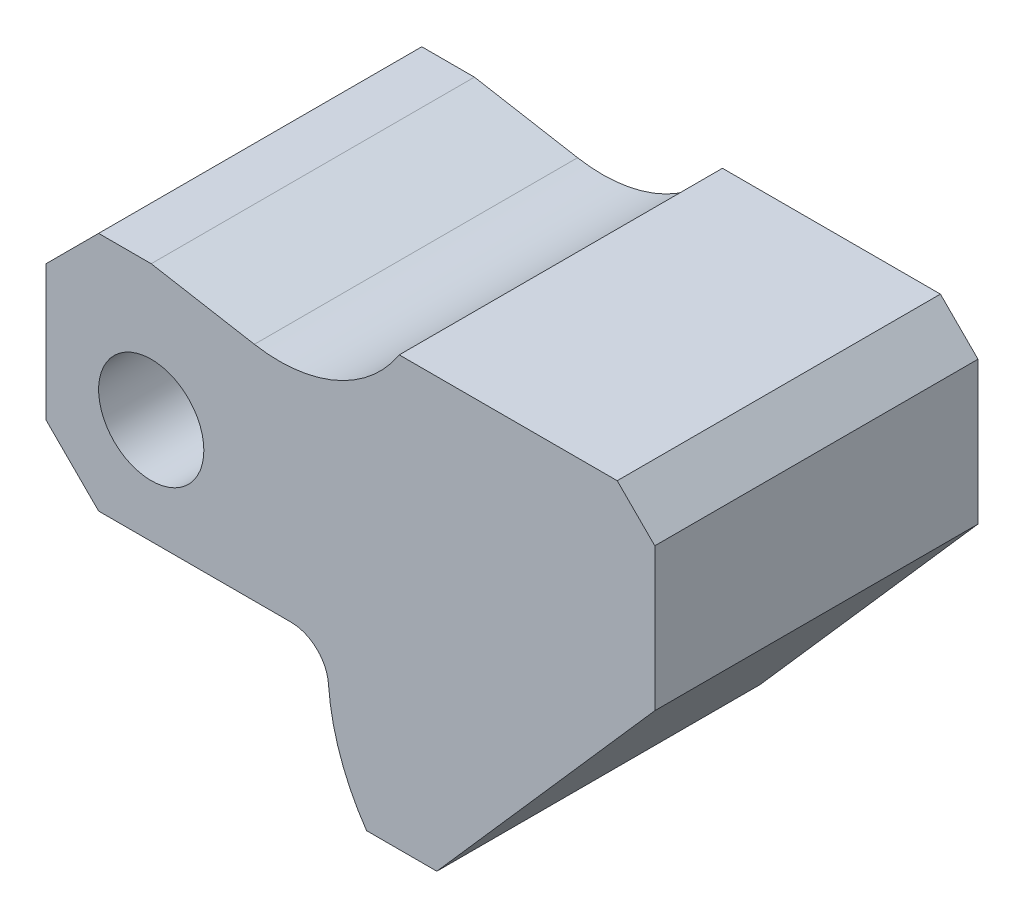
ISO-10303-21;
HEADER;
FILE_DESCRIPTION(('STEP AP214'),'2;1');
FILE_NAME('part.step','',(''),(''),'','','');
FILE_SCHEMA(('AUTOMOTIVE_DESIGN { 1 0 10303 214 1 1 1 1 }'));
ENDSEC;
DATA;
#1=APPLICATION_CONTEXT('core data for automotive mechanical design processes');
#2=APPLICATION_PROTOCOL_DEFINITION('international standard','automotive_design',2000,#1);
#3=PRODUCT_CONTEXT('',#1,'mechanical');
#4=PRODUCT('Part','Part','',(#3));
#5=PRODUCT_RELATED_PRODUCT_CATEGORY('part','',(#4));
#6=PRODUCT_DEFINITION_FORMATION('','',#4);
#7=PRODUCT_DEFINITION_CONTEXT('part definition',#1,'design');
#8=PRODUCT_DEFINITION('design','',#6,#7);
#9=PRODUCT_DEFINITION_SHAPE('','',#8);
#10=(LENGTH_UNIT() NAMED_UNIT(*) SI_UNIT(.MILLI.,.METRE.));
#11=(NAMED_UNIT(*) PLANE_ANGLE_UNIT() SI_UNIT($,.RADIAN.));
#12=(NAMED_UNIT(*) SI_UNIT($,.STERADIAN.) SOLID_ANGLE_UNIT());
#13=UNCERTAINTY_MEASURE_WITH_UNIT(LENGTH_MEASURE(1.E-05),#10,'distance_accuracy_value','');
#14=(GEOMETRIC_REPRESENTATION_CONTEXT(3) GLOBAL_UNCERTAINTY_ASSIGNED_CONTEXT((#13)) GLOBAL_UNIT_ASSIGNED_CONTEXT((#10,
#11,#12)) REPRESENTATION_CONTEXT('',''));
#15=CARTESIAN_POINT('',(0.,0.,0.));
#16=DIRECTION('',(0.,0.,1.));
#17=DIRECTION('',(1.,0.,0.));
#18=AXIS2_PLACEMENT_3D('',#15,#16,#17);
#19=CARTESIAN_POINT('',(17.028040312093,34.2906026902158,43.));
#20=DIRECTION('',(0.,0.,1.));
#21=DIRECTION('',(1.,0.,0.));
#22=AXIS2_PLACEMENT_3D('',#19,#20,#21);
#23=PLANE('',#22);
#24=DIRECTION('',(-0.707106781186544,-0.707106781186551,0.));
#25=VECTOR('',#24,1.);
#26=CARTESIAN_POINT('',(-14.,11.,43.));
#27=LINE('',#26,#25);
#28=CARTESIAN_POINT('',(-7.00000000000008,18.,43.));
#29=VERTEX_POINT('',#28);
#30=CARTESIAN_POINT('',(-14.,11.,43.));
#31=VERTEX_POINT('',#30);
#32=EDGE_CURVE('E204',#29,#31,#27,.T.);
#33=ORIENTED_EDGE('',*,*,#32,.T.);
#34=DIRECTION('',(0.,-1.,0.));
#35=VECTOR('',#34,1.);
#36=CARTESIAN_POINT('',(-14.,11.,43.));
#37=LINE('',#36,#35);
#38=CARTESIAN_POINT('',(-14.,-7.,43.));
#39=VERTEX_POINT('',#38);
#40=EDGE_CURVE('E122',#31,#39,#37,.T.);
#41=ORIENTED_EDGE('',*,*,#40,.T.);
#42=DIRECTION('',(0.707106781186549,-0.707106781186546,0.));
#43=VECTOR('',#42,1.);
#44=CARTESIAN_POINT('',(-14.,-7.,43.));
#45=LINE('',#44,#43);
#46=CARTESIAN_POINT('',(-6.99999999999997,-14.,43.));
#47=VERTEX_POINT('',#46);
#48=EDGE_CURVE('E237',#39,#47,#45,.T.);
#49=ORIENTED_EDGE('',*,*,#48,.T.);
#50=DIRECTION('',(1.,0.,0.));
#51=VECTOR('',#50,1.);
#52=CARTESIAN_POINT('',(-6.99999999999997,-14.,43.));
#53=LINE('',#52,#51);
#54=CARTESIAN_POINT('',(18.592036333628,-14.,43.));
#55=VERTEX_POINT('',#54);
#56=EDGE_CURVE('E256',#47,#55,#53,.T.);
#57=ORIENTED_EDGE('',*,*,#56,.T.);
#58=CARTESIAN_POINT('',(18.592036333628,-19.,43.));
#59=DIRECTION('',(0.,0.,-1.));
#60=DIRECTION('',(-1.,0.,0.));
#61=AXIS2_PLACEMENT_3D('',#58,#59,#60);
#62=CIRCLE('',#61,5.);
#63=CARTESIAN_POINT('',(23.5785015786828,-18.6323529411765,43.));
#64=VERTEX_POINT('',#63);
#65=EDGE_CURVE('E253',#55,#64,#62,.T.);
#66=ORIENTED_EDGE('',*,*,#65,.T.);
#67=CARTESIAN_POINT('',(52.5,-16.5,43.));
#68=DIRECTION('',(0.,0.,1.));
#69=DIRECTION('',(1.,0.,0.));
#70=AXIS2_PLACEMENT_3D('',#67,#68,#69);
#71=CIRCLE('',#70,29.);
#72=CARTESIAN_POINT('',(28.6515199645764,-33.,43.));
#73=VERTEX_POINT('',#72);
#74=EDGE_CURVE('E255',#64,#73,#71,.T.);
#75=ORIENTED_EDGE('',*,*,#74,.T.);
#76=DIRECTION('',(1.,0.,0.));
#77=VECTOR('',#76,1.);
#78=CARTESIAN_POINT('',(38.,-33.,43.));
#79=LINE('',#78,#77);
#80=CARTESIAN_POINT('',(38.,-33.,43.));
#81=VERTEX_POINT('',#80);
#82=EDGE_CURVE('E258',#73,#81,#79,.T.);
#83=ORIENTED_EDGE('',*,*,#82,.T.);
#84=DIRECTION('',(0.660114607728679,0.751164898449876,0.));
#85=VECTOR('',#84,1.);
#86=CARTESIAN_POINT('',(67.,0.,43.));
#87=LINE('',#86,#85);
#88=CARTESIAN_POINT('',(67.,0.,43.));
#89=VERTEX_POINT('',#88);
#90=EDGE_CURVE('E264',#81,#89,#87,.T.);
#91=ORIENTED_EDGE('',*,*,#90,.T.);
#92=DIRECTION('',(0.,1.,0.));
#93=VECTOR('',#92,1.);
#94=CARTESIAN_POINT('',(67.,19.,43.));
#95=LINE('',#94,#93);
#96=CARTESIAN_POINT('',(67.,19.,43.));
#97=VERTEX_POINT('',#96);
#98=EDGE_CURVE('E266',#89,#97,#95,.T.);
#99=ORIENTED_EDGE('',*,*,#98,.T.);
#100=DIRECTION('',(-0.707106781186552,0.707106781186543,0.));
#101=VECTOR('',#100,1.);
#102=CARTESIAN_POINT('',(61.9999999999999,24.,43.));
#103=LINE('',#102,#101);
#104=CARTESIAN_POINT('',(61.9999999999999,24.,43.));
#105=VERTEX_POINT('',#104);
#106=EDGE_CURVE('E268',#97,#105,#103,.T.);
#107=ORIENTED_EDGE('',*,*,#106,.T.);
#108=DIRECTION('',(-1.,0.,0.));
#109=VECTOR('',#108,1.);
#110=CARTESIAN_POINT('',(32.9999999999999,24.,43.));
#111=LINE('',#110,#109);
#112=CARTESIAN_POINT('',(32.9999999999999,24.,43.));
#113=VERTEX_POINT('',#112);
#114=EDGE_CURVE('E159',#105,#113,#111,.T.);
#115=ORIENTED_EDGE('',*,*,#114,.T.);
#116=CARTESIAN_POINT('',(17.028040312093,34.2906026902158,43.));
#117=DIRECTION('',(0.,0.,-1.));
#118=DIRECTION('',(1.,0.,0.));
#119=AXIS2_PLACEMENT_3D('',#116,#117,#118);
#120=CIRCLE('',#119,19.);
#121=CARTESIAN_POINT('',(13.7287249364213,15.5792553829838,43.));
#122=VERTEX_POINT('',#121);
#123=EDGE_CURVE('E153',#113,#122,#120,.T.);
#124=ORIENTED_EDGE('',*,*,#123,.T.);
#125=DIRECTION('',(-0.984807753012208,0.173648177666931,0.));
#126=VECTOR('',#125,1.);
#127=CARTESIAN_POINT('',(0.,18.,43.));
#128=LINE('',#127,#126);
#129=CARTESIAN_POINT('',(0.,18.,43.));
#130=VERTEX_POINT('',#129);
#131=EDGE_CURVE('E157',#122,#130,#128,.T.);
#132=ORIENTED_EDGE('',*,*,#131,.T.);
#133=DIRECTION('',(-1.,0.,0.));
#134=VECTOR('',#133,1.);
#135=CARTESIAN_POINT('',(-7.00000000000008,18.,43.));
#136=LINE('',#135,#134);
#137=EDGE_CURVE('E61',#130,#29,#136,.T.);
#138=ORIENTED_EDGE('',*,*,#137,.T.);
#139=EDGE_LOOP('',(#33,#41,#49,#57,#66,#75,#83,#91,#99,#107,#115,#124,#132,#138));
#140=FACE_BOUND('',#139,.T.);
#141=CARTESIAN_POINT('',(0.,0.,43.));
#142=DIRECTION('',(0.,0.,1.));
#143=DIRECTION('',(1.,0.,0.));
#144=AXIS2_PLACEMENT_3D('',#141,#142,#143);
#145=CIRCLE('',#144,7.);
#146=CARTESIAN_POINT('',(7.,0.,43.));
#147=VERTEX_POINT('',#146);
#148=EDGE_CURVE('E181',#147,#147,#145,.T.);
#149=ORIENTED_EDGE('',*,*,#148,.F.);
#150=EDGE_LOOP('',(#149));
#151=FACE_BOUND('',#150,.T.);
#152=ADVANCED_FACE('F44',(#140,#151),#23,.T.);
#153=CARTESIAN_POINT('',(17.028040312093,34.2906026902158,0.));
#154=DIRECTION('',(0.,0.,1.));
#155=DIRECTION('',(1.,0.,0.));
#156=AXIS2_PLACEMENT_3D('',#153,#154,#155);
#157=PLANE('',#156);
#158=DIRECTION('',(-0.707106781186544,-0.707106781186551,0.));
#159=VECTOR('',#158,1.);
#160=CARTESIAN_POINT('',(-14.,11.,0.));
#161=LINE('',#160,#159);
#162=CARTESIAN_POINT('',(-7.00000000000008,18.,0.));
#163=VERTEX_POINT('',#162);
#164=CARTESIAN_POINT('',(-14.,11.,0.));
#165=VERTEX_POINT('',#164);
#166=EDGE_CURVE('E177',#163,#165,#161,.T.);
#167=ORIENTED_EDGE('',*,*,#166,.F.);
#168=DIRECTION('',(-1.,0.,0.));
#169=VECTOR('',#168,1.);
#170=CARTESIAN_POINT('',(-7.00000000000008,18.,0.));
#171=LINE('',#170,#169);
#172=CARTESIAN_POINT('',(0.,18.,0.));
#173=VERTEX_POINT('',#172);
#174=EDGE_CURVE('E114',#173,#163,#171,.T.);
#175=ORIENTED_EDGE('',*,*,#174,.F.);
#176=DIRECTION('',(-0.984807753012208,0.173648177666931,0.));
#177=VECTOR('',#176,1.);
#178=CARTESIAN_POINT('',(0.,18.,0.));
#179=LINE('',#178,#177);
#180=CARTESIAN_POINT('',(13.7287249364213,15.5792553829838,0.));
#181=VERTEX_POINT('',#180);
#182=EDGE_CURVE('E108',#181,#173,#179,.T.);
#183=ORIENTED_EDGE('',*,*,#182,.F.);
#184=CARTESIAN_POINT('',(17.028040312093,34.2906026902158,0.));
#185=DIRECTION('',(0.,0.,-1.));
#186=DIRECTION('',(1.,0.,0.));
#187=AXIS2_PLACEMENT_3D('',#184,#185,#186);
#188=CIRCLE('',#187,19.);
#189=CARTESIAN_POINT('',(32.9999999999999,24.,0.));
#190=VERTEX_POINT('',#189);
#191=EDGE_CURVE('E167',#190,#181,#188,.T.);
#192=ORIENTED_EDGE('',*,*,#191,.F.);
#193=DIRECTION('',(-1.,0.,0.));
#194=VECTOR('',#193,1.);
#195=CARTESIAN_POINT('',(32.9999999999999,24.,0.));
#196=LINE('',#195,#194);
#197=CARTESIAN_POINT('',(61.9999999999999,24.,0.));
#198=VERTEX_POINT('',#197);
#199=EDGE_CURVE('E199',#198,#190,#196,.T.);
#200=ORIENTED_EDGE('',*,*,#199,.F.);
#201=DIRECTION('',(-0.707106781186552,0.707106781186543,0.));
#202=VECTOR('',#201,1.);
#203=CARTESIAN_POINT('',(61.9999999999999,24.,0.));
#204=LINE('',#203,#202);
#205=CARTESIAN_POINT('',(67.,19.,0.));
#206=VERTEX_POINT('',#205);
#207=EDGE_CURVE('E197',#206,#198,#204,.T.);
#208=ORIENTED_EDGE('',*,*,#207,.F.);
#209=DIRECTION('',(0.,1.,0.));
#210=VECTOR('',#209,1.);
#211=CARTESIAN_POINT('',(67.,19.,0.));
#212=LINE('',#211,#210);
#213=CARTESIAN_POINT('',(67.,0.,0.));
#214=VERTEX_POINT('',#213);
#215=EDGE_CURVE('E195',#214,#206,#212,.T.);
#216=ORIENTED_EDGE('',*,*,#215,.F.);
#217=DIRECTION('',(0.660114607728679,0.751164898449876,0.));
#218=VECTOR('',#217,1.);
#219=CARTESIAN_POINT('',(67.,0.,0.));
#220=LINE('',#219,#218);
#221=CARTESIAN_POINT('',(38.,-33.,0.));
#222=VERTEX_POINT('',#221);
#223=EDGE_CURVE('E193',#222,#214,#220,.T.);
#224=ORIENTED_EDGE('',*,*,#223,.F.);
#225=DIRECTION('',(1.,0.,0.));
#226=VECTOR('',#225,1.);
#227=CARTESIAN_POINT('',(38.,-33.,0.));
#228=LINE('',#227,#226);
#229=CARTESIAN_POINT('',(28.6515199645764,-33.,0.));
#230=VERTEX_POINT('',#229);
#231=EDGE_CURVE('E191',#230,#222,#228,.T.);
#232=ORIENTED_EDGE('',*,*,#231,.F.);
#233=CARTESIAN_POINT('',(52.5,-16.5,0.));
#234=DIRECTION('',(0.,0.,1.));
#235=DIRECTION('',(1.,0.,0.));
#236=AXIS2_PLACEMENT_3D('',#233,#234,#235);
#237=CIRCLE('',#236,29.);
#238=CARTESIAN_POINT('',(23.5785015786828,-18.6323529411765,0.));
#239=VERTEX_POINT('',#238);
#240=EDGE_CURVE('E189',#239,#230,#237,.T.);
#241=ORIENTED_EDGE('',*,*,#240,.F.);
#242=CARTESIAN_POINT('',(18.592036333628,-19.,0.));
#243=DIRECTION('',(0.,0.,-1.));
#244=DIRECTION('',(-1.,0.,0.));
#245=AXIS2_PLACEMENT_3D('',#242,#243,#244);
#246=CIRCLE('',#245,5.);
#247=CARTESIAN_POINT('',(18.592036333628,-14.,0.));
#248=VERTEX_POINT('',#247);
#249=EDGE_CURVE('E187',#248,#239,#246,.T.);
#250=ORIENTED_EDGE('',*,*,#249,.F.);
#251=DIRECTION('',(1.,0.,0.));
#252=VECTOR('',#251,1.);
#253=CARTESIAN_POINT('',(-6.99999999999997,-14.,0.));
#254=LINE('',#253,#252);
#255=CARTESIAN_POINT('',(-6.99999999999997,-14.,0.));
#256=VERTEX_POINT('',#255);
#257=EDGE_CURVE('E185',#256,#248,#254,.T.);
#258=ORIENTED_EDGE('',*,*,#257,.F.);
#259=DIRECTION('',(0.707106781186549,-0.707106781186546,0.));
#260=VECTOR('',#259,1.);
#261=CARTESIAN_POINT('',(-14.,-7.,0.));
#262=LINE('',#261,#260);
#263=CARTESIAN_POINT('',(-14.,-7.,0.));
#264=VERTEX_POINT('',#263);
#265=EDGE_CURVE('E183',#264,#256,#262,.T.);
#266=ORIENTED_EDGE('',*,*,#265,.F.);
#267=DIRECTION('',(0.,-1.,0.));
#268=VECTOR('',#267,1.);
#269=CARTESIAN_POINT('',(-14.,11.,0.));
#270=LINE('',#269,#268);
#271=EDGE_CURVE('E180',#165,#264,#270,.T.);
#272=ORIENTED_EDGE('',*,*,#271,.F.);
#273=EDGE_LOOP('',(#167,#175,#183,#192,#200,#208,#216,#224,#232,#241,#250,#258,#266,#272));
#274=FACE_BOUND('',#273,.T.);
#275=CARTESIAN_POINT('',(0.,0.,0.));
#276=DIRECTION('',(0.,0.,1.));
#277=DIRECTION('',(1.,0.,0.));
#278=AXIS2_PLACEMENT_3D('',#275,#276,#277);
#279=CIRCLE('',#278,7.);
#280=CARTESIAN_POINT('',(7.,0.,0.));
#281=VERTEX_POINT('',#280);
#282=EDGE_CURVE('E509',#281,#281,#279,.T.);
#283=ORIENTED_EDGE('',*,*,#282,.T.);
#284=EDGE_LOOP('',(#283));
#285=FACE_BOUND('',#284,.T.);
#286=ADVANCED_FACE('F241',(#274,#285),#157,.F.);
#287=CARTESIAN_POINT('',(-14.,11.,43.));
#288=DIRECTION('',(0.707106781186551,-0.707106781186544,0.));
#289=DIRECTION('',(0.707106781186544,0.707106781186551,0.));
#290=AXIS2_PLACEMENT_3D('',#287,#288,#289);
#291=PLANE('',#290);
#292=ORIENTED_EDGE('',*,*,#166,.T.);
#293=DIRECTION('',(0.,0.,-1.));
#294=VECTOR('',#293,1.);
#295=CARTESIAN_POINT('',(-14.,11.,43.));
#296=LINE('',#295,#294);
#297=EDGE_CURVE('E11',#31,#165,#296,.T.);
#298=ORIENTED_EDGE('',*,*,#297,.F.);
#299=ORIENTED_EDGE('',*,*,#32,.F.);
#300=DIRECTION('',(0.,0.,-1.));
#301=VECTOR('',#300,1.);
#302=CARTESIAN_POINT('',(-7.00000000000008,18.,43.));
#303=LINE('',#302,#301);
#304=EDGE_CURVE('E173',#29,#163,#303,.T.);
#305=ORIENTED_EDGE('',*,*,#304,.T.);
#306=EDGE_LOOP('',(#292,#298,#299,#305));
#307=FACE_BOUND('',#306,.T.);
#308=ADVANCED_FACE('F46',(#307),#291,.F.);
#309=CARTESIAN_POINT('',(-14.,11.,43.));
#310=DIRECTION('',(1.,0.,0.));
#311=DIRECTION('',(0.,1.,0.));
#312=AXIS2_PLACEMENT_3D('',#309,#310,#311);
#313=PLANE('',#312);
#314=ORIENTED_EDGE('',*,*,#271,.T.);
#315=DIRECTION('',(0.,0.,-1.));
#316=VECTOR('',#315,1.);
#317=CARTESIAN_POINT('',(-14.,-7.,43.));
#318=LINE('',#317,#316);
#319=EDGE_CURVE('E53',#39,#264,#318,.T.);
#320=ORIENTED_EDGE('',*,*,#319,.F.);
#321=ORIENTED_EDGE('',*,*,#40,.F.);
#322=ORIENTED_EDGE('',*,*,#297,.T.);
#323=EDGE_LOOP('',(#314,#320,#321,#322));
#324=FACE_BOUND('',#323,.T.);
#325=ADVANCED_FACE('F302',(#324),#313,.F.);
#326=CARTESIAN_POINT('',(-14.,-7.,43.));
#327=DIRECTION('',(0.707106781186546,0.707106781186549,0.));
#328=DIRECTION('',(-0.707106781186549,0.707106781186546,0.));
#329=AXIS2_PLACEMENT_3D('',#326,#327,#328);
#330=PLANE('',#329);
#331=ORIENTED_EDGE('',*,*,#265,.T.);
#332=DIRECTION('',(0.,0.,-1.));
#333=VECTOR('',#332,1.);
#334=CARTESIAN_POINT('',(-6.99999999999997,-14.,43.));
#335=LINE('',#334,#333);
#336=EDGE_CURVE('E229',#47,#256,#335,.T.);
#337=ORIENTED_EDGE('',*,*,#336,.F.);
#338=ORIENTED_EDGE('',*,*,#48,.F.);
#339=ORIENTED_EDGE('',*,*,#319,.T.);
#340=EDGE_LOOP('',(#331,#337,#338,#339));
#341=FACE_BOUND('',#340,.T.);
#342=ADVANCED_FACE('F235',(#341),#330,.F.);
#343=CARTESIAN_POINT('',(-6.99999999999997,-14.,43.));
#344=DIRECTION('',(0.,1.,0.));
#345=DIRECTION('',(-1.,0.,0.));
#346=AXIS2_PLACEMENT_3D('',#343,#344,#345);
#347=PLANE('',#346);
#348=ORIENTED_EDGE('',*,*,#257,.T.);
#349=DIRECTION('',(0.,0.,-1.));
#350=VECTOR('',#349,1.);
#351=CARTESIAN_POINT('',(18.592036333628,-14.,43.));
#352=LINE('',#351,#350);
#353=EDGE_CURVE('E226',#55,#248,#352,.T.);
#354=ORIENTED_EDGE('',*,*,#353,.F.);
#355=ORIENTED_EDGE('',*,*,#56,.F.);
#356=ORIENTED_EDGE('',*,*,#336,.T.);
#357=EDGE_LOOP('',(#348,#354,#355,#356));
#358=FACE_BOUND('',#357,.T.);
#359=ADVANCED_FACE('F247',(#358),#347,.F.);
#360=CARTESIAN_POINT('',(18.592036333628,-19.,43.));
#361=DIRECTION('',(0.,0.,-1.));
#362=DIRECTION('',(-1.,0.,0.));
#363=AXIS2_PLACEMENT_3D('',#360,#361,#362);
#364=CYLINDRICAL_SURFACE('',#363,5.);
#365=ORIENTED_EDGE('',*,*,#249,.T.);
#366=DIRECTION('',(0.,0.,-1.));
#367=VECTOR('',#366,1.);
#368=CARTESIAN_POINT('',(23.5785015786828,-18.6323529411765,43.));
#369=LINE('',#368,#367);
#370=EDGE_CURVE('E223',#64,#239,#369,.T.);
#371=ORIENTED_EDGE('',*,*,#370,.F.);
#372=ORIENTED_EDGE('',*,*,#65,.F.);
#373=ORIENTED_EDGE('',*,*,#353,.T.);
#374=EDGE_LOOP('',(#365,#371,#372,#373));
#375=FACE_BOUND('',#374,.T.);
#376=ADVANCED_FACE('F251',(#375),#364,.F.);
#377=CARTESIAN_POINT('',(52.5,-16.5,43.));
#378=DIRECTION('',(0.,0.,-1.));
#379=DIRECTION('',(-1.,0.,0.));
#380=AXIS2_PLACEMENT_3D('',#377,#378,#379);
#381=CYLINDRICAL_SURFACE('',#380,29.);
#382=ORIENTED_EDGE('',*,*,#240,.T.);
#383=DIRECTION('',(0.,0.,-1.));
#384=VECTOR('',#383,1.);
#385=CARTESIAN_POINT('',(28.6515199645764,-33.,43.));
#386=LINE('',#385,#384);
#387=EDGE_CURVE('E220',#73,#230,#386,.T.);
#388=ORIENTED_EDGE('',*,*,#387,.F.);
#389=ORIENTED_EDGE('',*,*,#74,.F.);
#390=ORIENTED_EDGE('',*,*,#370,.T.);
#391=EDGE_LOOP('',(#382,#388,#389,#390));
#392=FACE_BOUND('',#391,.T.);
#393=ADVANCED_FACE('F315',(#392),#381,.T.);
#394=CARTESIAN_POINT('',(38.,-33.,43.));
#395=DIRECTION('',(0.,1.,0.));
#396=DIRECTION('',(0.,0.,1.));
#397=AXIS2_PLACEMENT_3D('',#394,#395,#396);
#398=PLANE('',#397);
#399=ORIENTED_EDGE('',*,*,#231,.T.);
#400=DIRECTION('',(0.,0.,-1.));
#401=VECTOR('',#400,1.);
#402=CARTESIAN_POINT('',(38.,-33.,43.));
#403=LINE('',#402,#401);
#404=EDGE_CURVE('E217',#81,#222,#403,.T.);
#405=ORIENTED_EDGE('',*,*,#404,.F.);
#406=ORIENTED_EDGE('',*,*,#82,.F.);
#407=ORIENTED_EDGE('',*,*,#387,.T.);
#408=EDGE_LOOP('',(#399,#405,#406,#407));
#409=FACE_BOUND('',#408,.T.);
#410=ADVANCED_FACE('F318',(#409),#398,.F.);
#411=CARTESIAN_POINT('',(67.,0.,43.));
#412=DIRECTION('',(-0.751164898449876,0.660114607728679,0.));
#413=DIRECTION('',(-0.660114607728679,-0.751164898449876,0.));
#414=AXIS2_PLACEMENT_3D('',#411,#412,#413);
#415=PLANE('',#414);
#416=ORIENTED_EDGE('',*,*,#223,.T.);
#417=DIRECTION('',(0.,0.,-1.));
#418=VECTOR('',#417,1.);
#419=CARTESIAN_POINT('',(67.,0.,43.));
#420=LINE('',#419,#418);
#421=EDGE_CURVE('E214',#89,#214,#420,.T.);
#422=ORIENTED_EDGE('',*,*,#421,.F.);
#423=ORIENTED_EDGE('',*,*,#90,.F.);
#424=ORIENTED_EDGE('',*,*,#404,.T.);
#425=EDGE_LOOP('',(#416,#422,#423,#424));
#426=FACE_BOUND('',#425,.T.);
#427=ADVANCED_FACE('F322',(#426),#415,.F.);
#428=CARTESIAN_POINT('',(67.,19.,43.));
#429=DIRECTION('',(-1.,0.,0.));
#430=DIRECTION('',(0.,0.,1.));
#431=AXIS2_PLACEMENT_3D('',#428,#429,#430);
#432=PLANE('',#431);
#433=ORIENTED_EDGE('',*,*,#215,.T.);
#434=DIRECTION('',(0.,0.,-1.));
#435=VECTOR('',#434,1.);
#436=CARTESIAN_POINT('',(67.,19.,43.));
#437=LINE('',#436,#435);
#438=EDGE_CURVE('E211',#97,#206,#437,.T.);
#439=ORIENTED_EDGE('',*,*,#438,.F.);
#440=ORIENTED_EDGE('',*,*,#98,.F.);
#441=ORIENTED_EDGE('',*,*,#421,.T.);
#442=EDGE_LOOP('',(#433,#439,#440,#441));
#443=FACE_BOUND('',#442,.T.);
#444=ADVANCED_FACE('F326',(#443),#432,.F.);
#445=CARTESIAN_POINT('',(61.9999999999999,24.,43.));
#446=DIRECTION('',(-0.707106781186543,-0.707106781186552,0.));
#447=DIRECTION('',(0.707106781186552,-0.707106781186543,0.));
#448=AXIS2_PLACEMENT_3D('',#445,#446,#447);
#449=PLANE('',#448);
#450=ORIENTED_EDGE('',*,*,#207,.T.);
#451=DIRECTION('',(0.,0.,-1.));
#452=VECTOR('',#451,1.);
#453=CARTESIAN_POINT('',(61.9999999999999,24.,43.));
#454=LINE('',#453,#452);
#455=EDGE_CURVE('E208',#105,#198,#454,.T.);
#456=ORIENTED_EDGE('',*,*,#455,.F.);
#457=ORIENTED_EDGE('',*,*,#106,.F.);
#458=ORIENTED_EDGE('',*,*,#438,.T.);
#459=EDGE_LOOP('',(#450,#456,#457,#458));
#460=FACE_BOUND('',#459,.T.);
#461=ADVANCED_FACE('F274',(#460),#449,.F.);
#462=CARTESIAN_POINT('',(32.9999999999999,24.,43.));
#463=DIRECTION('',(0.,-1.,0.));
#464=DIRECTION('',(0.,0.,-1.));
#465=AXIS2_PLACEMENT_3D('',#462,#463,#464);
#466=PLANE('',#465);
#467=ORIENTED_EDGE('',*,*,#199,.T.);
#468=DIRECTION('',(0.,0.,-1.));
#469=VECTOR('',#468,1.);
#470=CARTESIAN_POINT('',(32.9999999999999,24.,43.));
#471=LINE('',#470,#469);
#472=EDGE_CURVE('E168',#113,#190,#471,.T.);
#473=ORIENTED_EDGE('',*,*,#472,.F.);
#474=ORIENTED_EDGE('',*,*,#114,.F.);
#475=ORIENTED_EDGE('',*,*,#455,.T.);
#476=EDGE_LOOP('',(#467,#473,#474,#475));
#477=FACE_BOUND('',#476,.T.);
#478=ADVANCED_FACE('F278',(#477),#466,.F.);
#479=CARTESIAN_POINT('',(17.028040312093,34.2906026902158,43.));
#480=DIRECTION('',(0.,0.,-1.));
#481=DIRECTION('',(-1.,0.,0.));
#482=AXIS2_PLACEMENT_3D('',#479,#480,#481);
#483=CYLINDRICAL_SURFACE('',#482,19.);
#484=ORIENTED_EDGE('',*,*,#191,.T.);
#485=DIRECTION('',(0.,0.,-1.));
#486=VECTOR('',#485,1.);
#487=CARTESIAN_POINT('',(13.7287249364213,15.5792553829838,43.));
#488=LINE('',#487,#486);
#489=EDGE_CURVE('E164',#122,#181,#488,.T.);
#490=ORIENTED_EDGE('',*,*,#489,.F.);
#491=ORIENTED_EDGE('',*,*,#123,.F.);
#492=ORIENTED_EDGE('',*,*,#472,.T.);
#493=EDGE_LOOP('',(#484,#490,#491,#492));
#494=FACE_BOUND('',#493,.T.);
#495=ADVANCED_FACE('F165',(#494),#483,.F.);
#496=CARTESIAN_POINT('',(0.,18.,43.));
#497=DIRECTION('',(-0.173648177666931,-0.984807753012208,0.));
#498=DIRECTION('',(0.984807753012208,-0.173648177666931,0.));
#499=AXIS2_PLACEMENT_3D('',#496,#497,#498);
#500=PLANE('',#499);
#501=ORIENTED_EDGE('',*,*,#182,.T.);
#502=DIRECTION('',(0.,0.,-1.));
#503=VECTOR('',#502,1.);
#504=CARTESIAN_POINT('',(0.,18.,43.));
#505=LINE('',#504,#503);
#506=EDGE_CURVE('E169',#130,#173,#505,.T.);
#507=ORIENTED_EDGE('',*,*,#506,.F.);
#508=ORIENTED_EDGE('',*,*,#131,.F.);
#509=ORIENTED_EDGE('',*,*,#489,.T.);
#510=EDGE_LOOP('',(#501,#507,#508,#509));
#511=FACE_BOUND('',#510,.T.);
#512=ADVANCED_FACE('F171',(#511),#500,.F.);
#513=CARTESIAN_POINT('',(-7.00000000000008,18.,43.));
#514=DIRECTION('',(0.,-1.,0.));
#515=DIRECTION('',(0.,0.,-1.));
#516=AXIS2_PLACEMENT_3D('',#513,#514,#515);
#517=PLANE('',#516);
#518=ORIENTED_EDGE('',*,*,#174,.T.);
#519=ORIENTED_EDGE('',*,*,#304,.F.);
#520=ORIENTED_EDGE('',*,*,#137,.F.);
#521=ORIENTED_EDGE('',*,*,#506,.T.);
#522=EDGE_LOOP('',(#518,#519,#520,#521));
#523=FACE_BOUND('',#522,.T.);
#524=ADVANCED_FACE('F282',(#523),#517,.F.);
#525=CARTESIAN_POINT('',(0.,0.,43.));
#526=DIRECTION('',(0.,0.,-1.));
#527=DIRECTION('',(-1.,0.,0.));
#528=AXIS2_PLACEMENT_3D('',#525,#526,#527);
#529=CYLINDRICAL_SURFACE('',#528,7.);
#530=ORIENTED_EDGE('',*,*,#148,.T.);
#531=EDGE_LOOP('',(#530));
#532=FACE_BOUND('',#531,.T.);
#533=ORIENTED_EDGE('',*,*,#282,.F.);
#534=EDGE_LOOP('',(#533));
#535=FACE_BOUND('',#534,.T.);
#536=ADVANCED_FACE('F284',(#532,#535),#529,.F.);
#537=CLOSED_SHELL('',(#152,#286,#308,#325,#342,#359,#376,#393,#410,#427,#444,#461,#478,#495,
#512,#524,#536));
#538=MANIFOLD_SOLID_BREP('B2',#537);
#539=ADVANCED_BREP_SHAPE_REPRESENTATION('',(#18,#538),#14);
#540=SHAPE_DEFINITION_REPRESENTATION(#9,#539);
ENDSEC;
END-ISO-10303-21;
